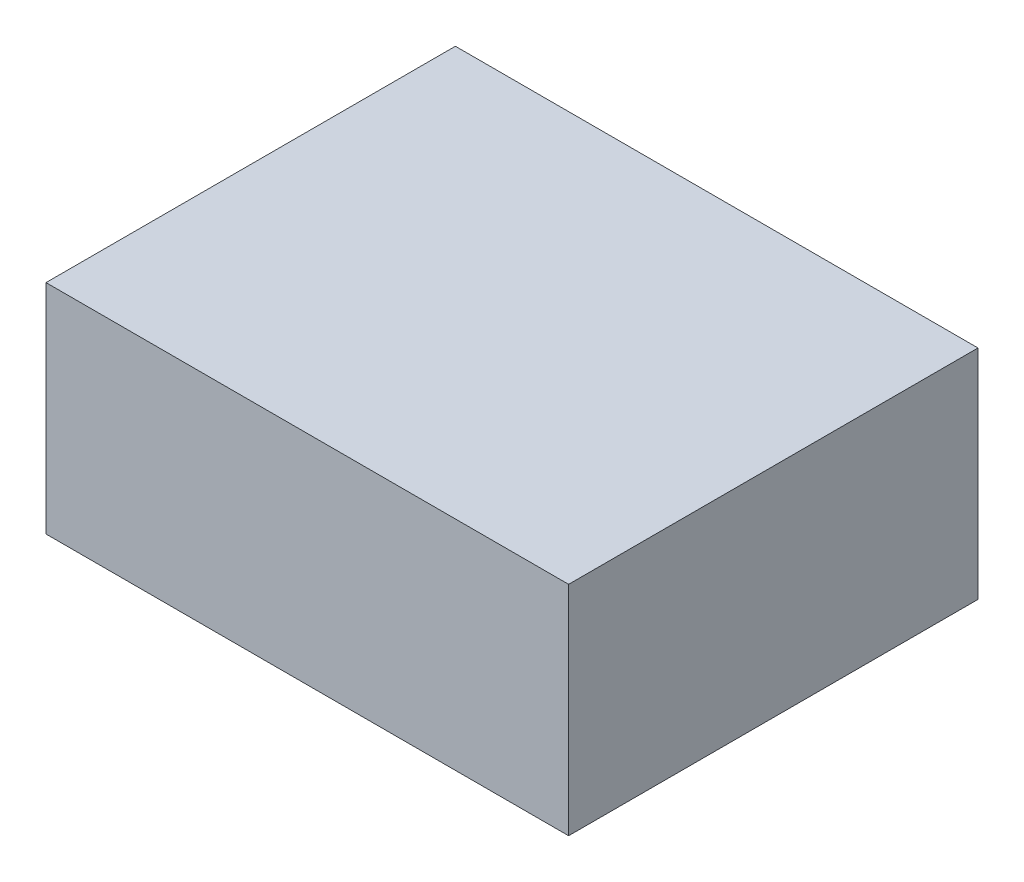
ISO-10303-21;
HEADER;
FILE_DESCRIPTION(('STEP AP214'),'2;1');
FILE_NAME('part.step','',(''),(''),'','','');
FILE_SCHEMA(('AUTOMOTIVE_DESIGN { 1 0 10303 214 1 1 1 1 }'));
ENDSEC;
DATA;
#1=APPLICATION_CONTEXT('core data for automotive mechanical design processes');
#2=APPLICATION_PROTOCOL_DEFINITION('international standard','automotive_design',2000,#1);
#3=PRODUCT_CONTEXT('',#1,'mechanical');
#4=PRODUCT('Part','Part','',(#3));
#5=PRODUCT_RELATED_PRODUCT_CATEGORY('part','',(#4));
#6=PRODUCT_DEFINITION_FORMATION('','',#4);
#7=PRODUCT_DEFINITION_CONTEXT('part definition',#1,'design');
#8=PRODUCT_DEFINITION('design','',#6,#7);
#9=PRODUCT_DEFINITION_SHAPE('','',#8);
#10=(LENGTH_UNIT() NAMED_UNIT(*) SI_UNIT(.MILLI.,.METRE.));
#11=(NAMED_UNIT(*) PLANE_ANGLE_UNIT() SI_UNIT($,.RADIAN.));
#12=(NAMED_UNIT(*) SI_UNIT($,.STERADIAN.) SOLID_ANGLE_UNIT());
#13=UNCERTAINTY_MEASURE_WITH_UNIT(LENGTH_MEASURE(1.E-05),#10,'distance_accuracy_value','');
#14=(GEOMETRIC_REPRESENTATION_CONTEXT(3) GLOBAL_UNCERTAINTY_ASSIGNED_CONTEXT((#13)) GLOBAL_UNIT_ASSIGNED_CONTEXT((#10,
#11,#12)) REPRESENTATION_CONTEXT('',''));
#15=CARTESIAN_POINT('',(0.,0.,0.));
#16=DIRECTION('',(0.,0.,1.));
#17=DIRECTION('',(1.,0.,0.));
#18=AXIS2_PLACEMENT_3D('',#15,#16,#17);
#19=CARTESIAN_POINT('',(30.,-6.25,-11.75));
#20=DIRECTION('',(0.,0.,1.));
#21=DIRECTION('',(1.,0.,0.));
#22=AXIS2_PLACEMENT_3D('',#19,#20,#21);
#23=PLANE('',#22);
#24=DIRECTION('',(0.,1.,0.));
#25=VECTOR('',#24,1.);
#26=CARTESIAN_POINT('',(0.,-6.25,-11.75));
#27=LINE('',#26,#25);
#28=CARTESIAN_POINT('',(0.,-6.25,-11.75));
#29=VERTEX_POINT('',#28);
#30=CARTESIAN_POINT('',(0.,6.25,-11.75));
#31=VERTEX_POINT('',#30);
#32=EDGE_CURVE('E96',#29,#31,#27,.T.);
#33=ORIENTED_EDGE('',*,*,#32,.T.);
#34=DIRECTION('',(-1.,0.,0.));
#35=VECTOR('',#34,1.);
#36=CARTESIAN_POINT('',(30.,6.25,-11.75));
#37=LINE('',#36,#35);
#38=CARTESIAN_POINT('',(30.,6.25,-11.75));
#39=VERTEX_POINT('',#38);
#40=EDGE_CURVE('E11',#39,#31,#37,.T.);
#41=ORIENTED_EDGE('',*,*,#40,.F.);
#42=DIRECTION('',(0.,1.,0.));
#43=VECTOR('',#42,1.);
#44=CARTESIAN_POINT('',(30.,-6.25,-11.75));
#45=LINE('',#44,#43);
#46=CARTESIAN_POINT('',(30.,-6.25,-11.75));
#47=VERTEX_POINT('',#46);
#48=EDGE_CURVE('E84',#47,#39,#45,.T.);
#49=ORIENTED_EDGE('',*,*,#48,.F.);
#50=DIRECTION('',(-1.,0.,0.));
#51=VECTOR('',#50,1.);
#52=CARTESIAN_POINT('',(30.,-6.25,-11.75));
#53=LINE('',#52,#51);
#54=EDGE_CURVE('E92',#47,#29,#53,.T.);
#55=ORIENTED_EDGE('',*,*,#54,.T.);
#56=EDGE_LOOP('',(#33,#41,#49,#55));
#57=FACE_BOUND('',#56,.T.);
#58=ADVANCED_FACE('F33',(#57),#23,.F.);
#59=CARTESIAN_POINT('',(30.,6.25,11.75));
#60=DIRECTION('',(0.,-1.,0.));
#61=DIRECTION('',(0.,0.,-1.));
#62=AXIS2_PLACEMENT_3D('',#59,#60,#61);
#63=PLANE('',#62);
#64=DIRECTION('',(0.,0.,1.));
#65=VECTOR('',#64,1.);
#66=CARTESIAN_POINT('',(0.,6.25,11.75));
#67=LINE('',#66,#65);
#68=CARTESIAN_POINT('',(0.,6.25,11.75));
#69=VERTEX_POINT('',#68);
#70=EDGE_CURVE('E88',#31,#69,#67,.T.);
#71=ORIENTED_EDGE('',*,*,#70,.T.);
#72=DIRECTION('',(-1.,0.,0.));
#73=VECTOR('',#72,1.);
#74=CARTESIAN_POINT('',(30.,6.25,11.75));
#75=LINE('',#74,#73);
#76=CARTESIAN_POINT('',(30.,6.25,11.75));
#77=VERTEX_POINT('',#76);
#78=EDGE_CURVE('E41',#77,#69,#75,.T.);
#79=ORIENTED_EDGE('',*,*,#78,.F.);
#80=DIRECTION('',(0.,0.,1.));
#81=VECTOR('',#80,1.);
#82=CARTESIAN_POINT('',(30.,6.25,11.75));
#83=LINE('',#82,#81);
#84=EDGE_CURVE('E79',#39,#77,#83,.T.);
#85=ORIENTED_EDGE('',*,*,#84,.F.);
#86=ORIENTED_EDGE('',*,*,#40,.T.);
#87=EDGE_LOOP('',(#71,#79,#85,#86));
#88=FACE_BOUND('',#87,.T.);
#89=ADVANCED_FACE('F87',(#88),#63,.F.);
#90=CARTESIAN_POINT('',(30.,-6.25,11.75));
#91=DIRECTION('',(0.,0.,-1.));
#92=DIRECTION('',(-1.,0.,0.));
#93=AXIS2_PLACEMENT_3D('',#90,#91,#92);
#94=PLANE('',#93);
#95=DIRECTION('',(0.,-1.,0.));
#96=VECTOR('',#95,1.);
#97=CARTESIAN_POINT('',(0.,-6.25,11.75));
#98=LINE('',#97,#96);
#99=CARTESIAN_POINT('',(0.,-6.25,11.75));
#100=VERTEX_POINT('',#99);
#101=EDGE_CURVE('E66',#69,#100,#98,.T.);
#102=ORIENTED_EDGE('',*,*,#101,.T.);
#103=DIRECTION('',(-1.,0.,0.));
#104=VECTOR('',#103,1.);
#105=CARTESIAN_POINT('',(30.,-6.25,11.75));
#106=LINE('',#105,#104);
#107=CARTESIAN_POINT('',(30.,-6.25,11.75));
#108=VERTEX_POINT('',#107);
#109=EDGE_CURVE('E89',#108,#100,#106,.T.);
#110=ORIENTED_EDGE('',*,*,#109,.F.);
#111=DIRECTION('',(0.,-1.,0.));
#112=VECTOR('',#111,1.);
#113=CARTESIAN_POINT('',(30.,-6.25,11.75));
#114=LINE('',#113,#112);
#115=EDGE_CURVE('E82',#77,#108,#114,.T.);
#116=ORIENTED_EDGE('',*,*,#115,.F.);
#117=ORIENTED_EDGE('',*,*,#78,.T.);
#118=EDGE_LOOP('',(#102,#110,#116,#117));
#119=FACE_BOUND('',#118,.T.);
#120=ADVANCED_FACE('F90',(#119),#94,.F.);
#121=CARTESIAN_POINT('',(30.,-6.25,11.75));
#122=DIRECTION('',(0.,1.,0.));
#123=DIRECTION('',(0.,0.,1.));
#124=AXIS2_PLACEMENT_3D('',#121,#122,#123);
#125=PLANE('',#124);
#126=DIRECTION('',(0.,0.,-1.));
#127=VECTOR('',#126,1.);
#128=CARTESIAN_POINT('',(0.,-6.25,11.75));
#129=LINE('',#128,#127);
#130=EDGE_CURVE('E72',#100,#29,#129,.T.);
#131=ORIENTED_EDGE('',*,*,#130,.T.);
#132=ORIENTED_EDGE('',*,*,#54,.F.);
#133=DIRECTION('',(0.,0.,-1.));
#134=VECTOR('',#133,1.);
#135=CARTESIAN_POINT('',(30.,-6.25,11.75));
#136=LINE('',#135,#134);
#137=EDGE_CURVE('E49',#108,#47,#136,.T.);
#138=ORIENTED_EDGE('',*,*,#137,.F.);
#139=ORIENTED_EDGE('',*,*,#109,.T.);
#140=EDGE_LOOP('',(#131,#132,#138,#139));
#141=FACE_BOUND('',#140,.T.);
#142=ADVANCED_FACE('F103',(#141),#125,.F.);
#143=CARTESIAN_POINT('',(30.,0.,0.));
#144=DIRECTION('',(-1.,0.,0.));
#145=DIRECTION('',(0.,0.,1.));
#146=AXIS2_PLACEMENT_3D('',#143,#144,#145);
#147=PLANE('',#146);
#148=ORIENTED_EDGE('',*,*,#48,.T.);
#149=ORIENTED_EDGE('',*,*,#84,.T.);
#150=ORIENTED_EDGE('',*,*,#115,.T.);
#151=ORIENTED_EDGE('',*,*,#137,.T.);
#152=EDGE_LOOP('',(#148,#149,#150,#151));
#153=FACE_BOUND('',#152,.T.);
#154=ADVANCED_FACE('F80',(#153),#147,.F.);
#155=CARTESIAN_POINT('',(0.,0.,0.));
#156=DIRECTION('',(-1.,0.,0.));
#157=DIRECTION('',(0.,0.,1.));
#158=AXIS2_PLACEMENT_3D('',#155,#156,#157);
#159=PLANE('',#158);
#160=ORIENTED_EDGE('',*,*,#32,.F.);
#161=ORIENTED_EDGE('',*,*,#130,.F.);
#162=ORIENTED_EDGE('',*,*,#101,.F.);
#163=ORIENTED_EDGE('',*,*,#70,.F.);
#164=EDGE_LOOP('',(#160,#161,#162,#163));
#165=FACE_BOUND('',#164,.T.);
#166=ADVANCED_FACE('F106',(#165),#159,.T.);
#167=CLOSED_SHELL('',(#58,#89,#120,#142,#154,#166));
#168=MANIFOLD_SOLID_BREP('B2',#167);
#169=ADVANCED_BREP_SHAPE_REPRESENTATION('',(#18,#168),#14);
#170=SHAPE_DEFINITION_REPRESENTATION(#9,#169);
ENDSEC;
END-ISO-10303-21;
